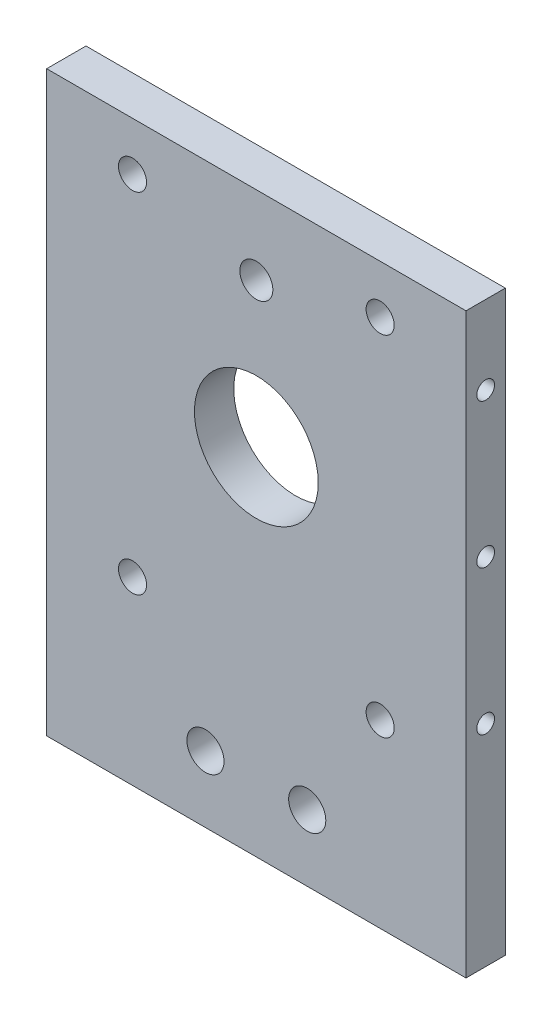
ISO-10303-21;
HEADER;
FILE_DESCRIPTION(('STEP AP214'),'2;1');
FILE_NAME('part.step','',(''),(''),'','','');
FILE_SCHEMA(('AUTOMOTIVE_DESIGN { 1 0 10303 214 1 1 1 1 }'));
ENDSEC;
DATA;
#1=APPLICATION_CONTEXT('core data for automotive mechanical design processes');
#2=APPLICATION_PROTOCOL_DEFINITION('international standard','automotive_design',2000,#1);
#3=PRODUCT_CONTEXT('',#1,'mechanical');
#4=PRODUCT('Part','Part','',(#3));
#5=PRODUCT_RELATED_PRODUCT_CATEGORY('part','',(#4));
#6=PRODUCT_DEFINITION_FORMATION('','',#4);
#7=PRODUCT_DEFINITION_CONTEXT('part definition',#1,'design');
#8=PRODUCT_DEFINITION('design','',#6,#7);
#9=PRODUCT_DEFINITION_SHAPE('','',#8);
#10=(LENGTH_UNIT() NAMED_UNIT(*) SI_UNIT(.MILLI.,.METRE.));
#11=(NAMED_UNIT(*) PLANE_ANGLE_UNIT() SI_UNIT($,.RADIAN.));
#12=(NAMED_UNIT(*) SI_UNIT($,.STERADIAN.) SOLID_ANGLE_UNIT());
#13=UNCERTAINTY_MEASURE_WITH_UNIT(LENGTH_MEASURE(1.E-05),#10,'distance_accuracy_value','');
#14=(GEOMETRIC_REPRESENTATION_CONTEXT(3) GLOBAL_UNCERTAINTY_ASSIGNED_CONTEXT((#13)) GLOBAL_UNIT_ASSIGNED_CONTEXT((#10,
#11,#12)) REPRESENTATION_CONTEXT('',''));
#15=CARTESIAN_POINT('',(0.,0.,0.));
#16=DIRECTION('',(0.,0.,1.));
#17=DIRECTION('',(1.,0.,0.));
#18=AXIS2_PLACEMENT_3D('',#15,#16,#17);
#19=CARTESIAN_POINT('',(50.8,54.,9.525));
#20=DIRECTION('',(-1.,0.,0.));
#21=DIRECTION('',(0.,-1.,0.));
#22=AXIS2_PLACEMENT_3D('',#19,#20,#21);
#23=PLANE('',#22);
#24=CARTESIAN_POINT('',(50.8,35.,4.76250000000001));
#25=DIRECTION('',(1.,0.,0.));
#26=DIRECTION('',(0.,-1.,0.));
#27=AXIS2_PLACEMENT_3D('',#24,#25,#26);
#28=CIRCLE('',#27,2.15);
#29=CARTESIAN_POINT('',(50.8,32.85,4.76250000000001));
#30=VERTEX_POINT('',#29);
#31=EDGE_CURVE('E103',#30,#30,#28,.T.);
#32=ORIENTED_EDGE('',*,*,#31,.F.);
#33=EDGE_LOOP('',(#32));
#34=FACE_BOUND('',#33,.T.);
#35=CARTESIAN_POINT('',(50.8,-35.,4.7625));
#36=DIRECTION('',(1.,0.,0.));
#37=DIRECTION('',(0.,1.,0.));
#38=AXIS2_PLACEMENT_3D('',#35,#36,#37);
#39=CIRCLE('',#38,2.15);
#40=CARTESIAN_POINT('',(50.8,-32.85,4.7625));
#41=VERTEX_POINT('',#40);
#42=EDGE_CURVE('E108',#41,#41,#39,.T.);
#43=ORIENTED_EDGE('',*,*,#42,.F.);
#44=EDGE_LOOP('',(#43));
#45=FACE_BOUND('',#44,.T.);
#46=CARTESIAN_POINT('',(50.8,0.,4.7625));
#47=DIRECTION('',(1.,0.,0.));
#48=DIRECTION('',(0.,1.,0.));
#49=AXIS2_PLACEMENT_3D('',#46,#47,#48);
#50=CIRCLE('',#49,2.15);
#51=CARTESIAN_POINT('',(50.8,2.15000000000001,4.7625));
#52=VERTEX_POINT('',#51);
#53=EDGE_CURVE('E107',#52,#52,#50,.T.);
#54=ORIENTED_EDGE('',*,*,#53,.F.);
#55=EDGE_LOOP('',(#54));
#56=FACE_BOUND('',#55,.T.);
#57=DIRECTION('',(0.,1.,0.));
#58=VECTOR('',#57,1.);
#59=CARTESIAN_POINT('',(50.8,54.,0.));
#60=LINE('',#59,#58);
#61=CARTESIAN_POINT('',(50.8,-86.,0.));
#62=VERTEX_POINT('',#61);
#63=CARTESIAN_POINT('',(50.8,54.,0.));
#64=VERTEX_POINT('',#63);
#65=EDGE_CURVE('E167',#62,#64,#60,.T.);
#66=ORIENTED_EDGE('',*,*,#65,.T.);
#67=DIRECTION('',(0.,0.,-1.));
#68=VECTOR('',#67,1.);
#69=CARTESIAN_POINT('',(50.8,54.,9.525));
#70=LINE('',#69,#68);
#71=CARTESIAN_POINT('',(50.8,54.,9.525));
#72=VERTEX_POINT('',#71);
#73=EDGE_CURVE('E11',#72,#64,#70,.T.);
#74=ORIENTED_EDGE('',*,*,#73,.F.);
#75=DIRECTION('',(0.,1.,0.));
#76=VECTOR('',#75,1.);
#77=CARTESIAN_POINT('',(50.8,54.,9.525));
#78=LINE('',#77,#76);
#79=CARTESIAN_POINT('',(50.8,-86.,9.525));
#80=VERTEX_POINT('',#79);
#81=EDGE_CURVE('E170',#80,#72,#78,.T.);
#82=ORIENTED_EDGE('',*,*,#81,.F.);
#83=DIRECTION('',(0.,0.,1.));
#84=VECTOR('',#83,1.);
#85=CARTESIAN_POINT('',(50.8,-86.,-106.520232819873));
#86=LINE('',#85,#84);
#87=EDGE_CURVE('E88',#62,#80,#86,.T.);
#88=ORIENTED_EDGE('',*,*,#87,.F.);
#89=EDGE_LOOP('',(#66,#74,#82,#88));
#90=FACE_BOUND('',#89,.T.);
#91=ADVANCED_FACE('F33',(#34,#45,#56,#90),#23,.F.);
#92=CARTESIAN_POINT('',(-50.8,54.,9.525));
#93=DIRECTION('',(0.,-1.,0.));
#94=DIRECTION('',(0.,0.,-1.));
#95=AXIS2_PLACEMENT_3D('',#92,#93,#94);
#96=PLANE('',#95);
#97=DIRECTION('',(-1.,0.,0.));
#98=VECTOR('',#97,1.);
#99=CARTESIAN_POINT('',(-50.8,54.,0.));
#100=LINE('',#99,#98);
#101=CARTESIAN_POINT('',(-50.8,54.,0.));
#102=VERTEX_POINT('',#101);
#103=EDGE_CURVE('E62',#64,#102,#100,.T.);
#104=ORIENTED_EDGE('',*,*,#103,.T.);
#105=DIRECTION('',(0.,0.,-1.));
#106=VECTOR('',#105,1.);
#107=CARTESIAN_POINT('',(-50.8,54.,9.525));
#108=LINE('',#107,#106);
#109=CARTESIAN_POINT('',(-50.8,54.,9.525));
#110=VERTEX_POINT('',#109);
#111=EDGE_CURVE('E42',#110,#102,#108,.T.);
#112=ORIENTED_EDGE('',*,*,#111,.F.);
#113=DIRECTION('',(-1.,0.,0.));
#114=VECTOR('',#113,1.);
#115=CARTESIAN_POINT('',(-50.8,54.,9.525));
#116=LINE('',#115,#114);
#117=EDGE_CURVE('E51',#72,#110,#116,.T.);
#118=ORIENTED_EDGE('',*,*,#117,.F.);
#119=ORIENTED_EDGE('',*,*,#73,.T.);
#120=EDGE_LOOP('',(#104,#112,#118,#119));
#121=FACE_BOUND('',#120,.T.);
#122=ADVANCED_FACE('F203',(#121),#96,.F.);
#123=CARTESIAN_POINT('',(-50.8,54.,9.525));
#124=DIRECTION('',(1.,0.,0.));
#125=DIRECTION('',(0.,1.,0.));
#126=AXIS2_PLACEMENT_3D('',#123,#124,#125);
#127=PLANE('',#126);
#128=CARTESIAN_POINT('',(-50.8,35.,4.76250000000001));
#129=DIRECTION('',(-1.,0.,0.));
#130=DIRECTION('',(0.,1.,0.));
#131=AXIS2_PLACEMENT_3D('',#128,#129,#130);
#132=CIRCLE('',#131,2.15);
#133=CARTESIAN_POINT('',(-50.8,37.15,4.76250000000001));
#134=VERTEX_POINT('',#133);
#135=EDGE_CURVE('E119',#134,#134,#132,.T.);
#136=ORIENTED_EDGE('',*,*,#135,.F.);
#137=EDGE_LOOP('',(#136));
#138=FACE_BOUND('',#137,.T.);
#139=CARTESIAN_POINT('',(-50.8,-35.,4.76250000000001));
#140=DIRECTION('',(-1.,0.,0.));
#141=DIRECTION('',(0.,-1.,0.));
#142=AXIS2_PLACEMENT_3D('',#139,#140,#141);
#143=CIRCLE('',#142,2.15);
#144=CARTESIAN_POINT('',(-50.8,-37.15,4.76250000000001));
#145=VERTEX_POINT('',#144);
#146=EDGE_CURVE('E126',#145,#145,#143,.T.);
#147=ORIENTED_EDGE('',*,*,#146,.F.);
#148=EDGE_LOOP('',(#147));
#149=FACE_BOUND('',#148,.T.);
#150=CARTESIAN_POINT('',(-50.8,0.,4.7625));
#151=DIRECTION('',(-1.,0.,0.));
#152=DIRECTION('',(0.,-1.,0.));
#153=AXIS2_PLACEMENT_3D('',#150,#151,#152);
#154=CIRCLE('',#153,2.15);
#155=CARTESIAN_POINT('',(-50.8,-2.14999999999999,4.7625));
#156=VERTEX_POINT('',#155);
#157=EDGE_CURVE('E125',#156,#156,#154,.T.);
#158=ORIENTED_EDGE('',*,*,#157,.F.);
#159=EDGE_LOOP('',(#158));
#160=FACE_BOUND('',#159,.T.);
#161=DIRECTION('',(0.,-1.,0.));
#162=VECTOR('',#161,1.);
#163=CARTESIAN_POINT('',(-50.8,54.,0.));
#164=LINE('',#163,#162);
#165=CARTESIAN_POINT('',(-50.7999999999999,-86.,0.));
#166=VERTEX_POINT('',#165);
#167=EDGE_CURVE('E68',#102,#166,#164,.T.);
#168=ORIENTED_EDGE('',*,*,#167,.T.);
#169=DIRECTION('',(0.,0.,1.));
#170=VECTOR('',#169,1.);
#171=CARTESIAN_POINT('',(-50.7999999999999,-86.,-106.520232819873));
#172=LINE('',#171,#170);
#173=CARTESIAN_POINT('',(-50.7999999999999,-86.,9.525));
#174=VERTEX_POINT('',#173);
#175=EDGE_CURVE('E84',#166,#174,#172,.T.);
#176=ORIENTED_EDGE('',*,*,#175,.T.);
#177=DIRECTION('',(0.,-1.,0.));
#178=VECTOR('',#177,1.);
#179=CARTESIAN_POINT('',(-50.8,54.,9.525));
#180=LINE('',#179,#178);
#181=EDGE_CURVE('E78',#110,#174,#180,.T.);
#182=ORIENTED_EDGE('',*,*,#181,.F.);
#183=ORIENTED_EDGE('',*,*,#111,.T.);
#184=EDGE_LOOP('',(#168,#176,#182,#183));
#185=FACE_BOUND('',#184,.T.);
#186=ADVANCED_FACE('F85',(#138,#149,#160,#185),#127,.F.);
#187=CARTESIAN_POINT('',(0.,0.,9.525));
#188=DIRECTION('',(0.,0.,1.));
#189=DIRECTION('',(1.,0.,0.));
#190=AXIS2_PLACEMENT_3D('',#187,#188,#189);
#191=PLANE('',#190);
#192=CARTESIAN_POINT('',(12.3290206143521,-69.9213504638668,9.525));
#193=DIRECTION('',(0.,0.,1.));
#194=DIRECTION('',(1.,0.,0.));
#195=AXIS2_PLACEMENT_3D('',#192,#193,#194);
#196=CIRCLE('',#195,4.5);
#197=CARTESIAN_POINT('',(16.8290206143521,-69.9213504638668,9.525));
#198=VERTEX_POINT('',#197);
#199=EDGE_CURVE('E180',#198,#198,#196,.T.);
#200=ORIENTED_EDGE('',*,*,#199,.F.);
#201=EDGE_LOOP('',(#200));
#202=FACE_BOUND('',#201,.T.);
#203=CARTESIAN_POINT('',(-12.3290206143521,-69.9213504638668,9.525));
#204=DIRECTION('',(0.,0.,1.));
#205=DIRECTION('',(-1.,0.,0.));
#206=AXIS2_PLACEMENT_3D('',#203,#204,#205);
#207=CIRCLE('',#206,4.5);
#208=CARTESIAN_POINT('',(-16.8290206143521,-69.9213504638668,9.525));
#209=VERTEX_POINT('',#208);
#210=EDGE_CURVE('E508',#209,#209,#207,.T.);
#211=ORIENTED_EDGE('',*,*,#210,.F.);
#212=EDGE_LOOP('',(#211));
#213=FACE_BOUND('',#212,.T.);
#214=CARTESIAN_POINT('',(0.,35.0048847139097,9.525));
#215=DIRECTION('',(0.,0.,1.));
#216=DIRECTION('',(1.,0.,0.));
#217=AXIS2_PLACEMENT_3D('',#214,#215,#216);
#218=CIRCLE('',#217,4.);
#219=CARTESIAN_POINT('',(4.,35.0048847139097,9.525));
#220=VERTEX_POINT('',#219);
#221=EDGE_CURVE('E98',#220,#220,#218,.T.);
#222=ORIENTED_EDGE('',*,*,#221,.F.);
#223=EDGE_LOOP('',(#222));
#224=FACE_BOUND('',#223,.T.);
#225=CARTESIAN_POINT('',(-30.,42.25,9.525));
#226=DIRECTION('',(0.,0.,1.));
#227=DIRECTION('',(1.,0.,0.));
#228=AXIS2_PLACEMENT_3D('',#225,#226,#227);
#229=CIRCLE('',#228,3.4);
#230=CARTESIAN_POINT('',(-26.6,42.25,9.525));
#231=VERTEX_POINT('',#230);
#232=EDGE_CURVE('E137',#231,#231,#229,.T.);
#233=ORIENTED_EDGE('',*,*,#232,.F.);
#234=EDGE_LOOP('',(#233));
#235=FACE_BOUND('',#234,.T.);
#236=CARTESIAN_POINT('',(30.,42.25,9.525));
#237=DIRECTION('',(0.,0.,1.));
#238=DIRECTION('',(-1.,0.,0.));
#239=AXIS2_PLACEMENT_3D('',#236,#237,#238);
#240=CIRCLE('',#239,3.4);
#241=CARTESIAN_POINT('',(26.6,42.25,9.525));
#242=VERTEX_POINT('',#241);
#243=EDGE_CURVE('E156',#242,#242,#240,.T.);
#244=ORIENTED_EDGE('',*,*,#243,.F.);
#245=EDGE_LOOP('',(#244));
#246=FACE_BOUND('',#245,.T.);
#247=CARTESIAN_POINT('',(-30.,-42.25,9.525));
#248=DIRECTION('',(0.,0.,1.));
#249=DIRECTION('',(-1.,0.,0.));
#250=AXIS2_PLACEMENT_3D('',#247,#248,#249);
#251=CIRCLE('',#250,3.4);
#252=CARTESIAN_POINT('',(-33.4,-42.25,9.525));
#253=VERTEX_POINT('',#252);
#254=EDGE_CURVE('E150',#253,#253,#251,.T.);
#255=ORIENTED_EDGE('',*,*,#254,.F.);
#256=EDGE_LOOP('',(#255));
#257=FACE_BOUND('',#256,.T.);
#258=CARTESIAN_POINT('',(30.,-42.25,9.525));
#259=DIRECTION('',(0.,0.,1.));
#260=DIRECTION('',(1.,0.,0.));
#261=AXIS2_PLACEMENT_3D('',#258,#259,#260);
#262=CIRCLE('',#261,3.4);
#263=CARTESIAN_POINT('',(33.4,-42.25,9.525));
#264=VERTEX_POINT('',#263);
#265=EDGE_CURVE('E144',#264,#264,#262,.T.);
#266=ORIENTED_EDGE('',*,*,#265,.F.);
#267=EDGE_LOOP('',(#266));
#268=FACE_BOUND('',#267,.T.);
#269=CARTESIAN_POINT('',(0.,0.,9.525));
#270=DIRECTION('',(0.,0.,1.));
#271=DIRECTION('',(1.,0.,0.));
#272=AXIS2_PLACEMENT_3D('',#269,#270,#271);
#273=CIRCLE('',#272,15.);
#274=CARTESIAN_POINT('',(15.,0.,9.525));
#275=VERTEX_POINT('',#274);
#276=EDGE_CURVE('E143',#275,#275,#273,.T.);
#277=ORIENTED_EDGE('',*,*,#276,.F.);
#278=EDGE_LOOP('',(#277));
#279=FACE_BOUND('',#278,.T.);
#280=ORIENTED_EDGE('',*,*,#81,.T.);
#281=ORIENTED_EDGE('',*,*,#117,.T.);
#282=ORIENTED_EDGE('',*,*,#181,.T.);
#283=DIRECTION('',(1.,0.,0.));
#284=VECTOR('',#283,1.);
#285=CARTESIAN_POINT('',(-50.7999999999999,-86.,9.525));
#286=LINE('',#285,#284);
#287=EDGE_CURVE('E81',#174,#80,#286,.T.);
#288=ORIENTED_EDGE('',*,*,#287,.T.);
#289=EDGE_LOOP('',(#280,#281,#282,#288));
#290=FACE_BOUND('',#289,.T.);
#291=ADVANCED_FACE('F79',(#202,#213,#224,#235,#246,#257,#268,#279,#290),#191,.T.);
#292=CARTESIAN_POINT('',(0.,0.,0.));
#293=DIRECTION('',(0.,0.,1.));
#294=DIRECTION('',(1.,0.,0.));
#295=AXIS2_PLACEMENT_3D('',#292,#293,#294);
#296=PLANE('',#295);
#297=CARTESIAN_POINT('',(12.3290206143521,-69.9213504638668,0.));
#298=DIRECTION('',(0.,0.,1.));
#299=DIRECTION('',(1.,0.,0.));
#300=AXIS2_PLACEMENT_3D('',#297,#298,#299);
#301=CIRCLE('',#300,4.5);
#302=CARTESIAN_POINT('',(16.8290206143521,-69.9213504638668,0.));
#303=VERTEX_POINT('',#302);
#304=EDGE_CURVE('E36',#303,#303,#301,.T.);
#305=ORIENTED_EDGE('',*,*,#304,.T.);
#306=EDGE_LOOP('',(#305));
#307=FACE_BOUND('',#306,.T.);
#308=CARTESIAN_POINT('',(-12.3290206143521,-69.9213504638668,0.));
#309=DIRECTION('',(0.,0.,1.));
#310=DIRECTION('',(1.,0.,0.));
#311=AXIS2_PLACEMENT_3D('',#308,#309,#310);
#312=CIRCLE('',#311,4.5);
#313=CARTESIAN_POINT('',(-7.82902061435211,-69.9213504638668,0.));
#314=VERTEX_POINT('',#313);
#315=EDGE_CURVE('E95',#314,#314,#312,.T.);
#316=ORIENTED_EDGE('',*,*,#315,.T.);
#317=EDGE_LOOP('',(#316));
#318=FACE_BOUND('',#317,.T.);
#319=CARTESIAN_POINT('',(0.,35.0048847139097,0.));
#320=DIRECTION('',(0.,0.,1.));
#321=DIRECTION('',(1.,0.,0.));
#322=AXIS2_PLACEMENT_3D('',#319,#320,#321);
#323=CIRCLE('',#322,4.);
#324=CARTESIAN_POINT('',(4.,35.0048847139097,0.));
#325=VERTEX_POINT('',#324);
#326=EDGE_CURVE('E178',#325,#325,#323,.T.);
#327=ORIENTED_EDGE('',*,*,#326,.T.);
#328=EDGE_LOOP('',(#327));
#329=FACE_BOUND('',#328,.T.);
#330=CARTESIAN_POINT('',(-30.,42.25,0.));
#331=DIRECTION('',(0.,0.,1.));
#332=DIRECTION('',(1.,0.,0.));
#333=AXIS2_PLACEMENT_3D('',#330,#331,#332);
#334=CIRCLE('',#333,3.4);
#335=CARTESIAN_POINT('',(-26.6,42.25,0.));
#336=VERTEX_POINT('',#335);
#337=EDGE_CURVE('E159',#336,#336,#334,.T.);
#338=ORIENTED_EDGE('',*,*,#337,.T.);
#339=EDGE_LOOP('',(#338));
#340=FACE_BOUND('',#339,.T.);
#341=CARTESIAN_POINT('',(30.,42.25,0.));
#342=DIRECTION('',(0.,0.,1.));
#343=DIRECTION('',(-1.,0.,0.));
#344=AXIS2_PLACEMENT_3D('',#341,#342,#343);
#345=CIRCLE('',#344,3.4);
#346=CARTESIAN_POINT('',(26.6,42.25,0.));
#347=VERTEX_POINT('',#346);
#348=EDGE_CURVE('E153',#347,#347,#345,.T.);
#349=ORIENTED_EDGE('',*,*,#348,.T.);
#350=EDGE_LOOP('',(#349));
#351=FACE_BOUND('',#350,.T.);
#352=CARTESIAN_POINT('',(-30.,-42.25,0.));
#353=DIRECTION('',(0.,0.,1.));
#354=DIRECTION('',(-1.,0.,0.));
#355=AXIS2_PLACEMENT_3D('',#352,#353,#354);
#356=CIRCLE('',#355,3.4);
#357=CARTESIAN_POINT('',(-33.4,-42.25,0.));
#358=VERTEX_POINT('',#357);
#359=EDGE_CURVE('E147',#358,#358,#356,.T.);
#360=ORIENTED_EDGE('',*,*,#359,.T.);
#361=EDGE_LOOP('',(#360));
#362=FACE_BOUND('',#361,.T.);
#363=CARTESIAN_POINT('',(30.,-42.25,0.));
#364=DIRECTION('',(0.,0.,1.));
#365=DIRECTION('',(1.,0.,0.));
#366=AXIS2_PLACEMENT_3D('',#363,#364,#365);
#367=CIRCLE('',#366,3.4);
#368=CARTESIAN_POINT('',(33.4,-42.25,0.));
#369=VERTEX_POINT('',#368);
#370=EDGE_CURVE('E140',#369,#369,#367,.T.);
#371=ORIENTED_EDGE('',*,*,#370,.T.);
#372=EDGE_LOOP('',(#371));
#373=FACE_BOUND('',#372,.T.);
#374=CARTESIAN_POINT('',(0.,0.,0.));
#375=DIRECTION('',(0.,0.,1.));
#376=DIRECTION('',(1.,0.,0.));
#377=AXIS2_PLACEMENT_3D('',#374,#375,#376);
#378=CIRCLE('',#377,15.);
#379=CARTESIAN_POINT('',(15.,0.,0.));
#380=VERTEX_POINT('',#379);
#381=EDGE_CURVE('E164',#380,#380,#378,.T.);
#382=ORIENTED_EDGE('',*,*,#381,.T.);
#383=EDGE_LOOP('',(#382));
#384=FACE_BOUND('',#383,.T.);
#385=ORIENTED_EDGE('',*,*,#65,.F.);
#386=DIRECTION('',(-1.,0.,0.));
#387=VECTOR('',#386,1.);
#388=CARTESIAN_POINT('',(-50.7999999999999,-86.,0.));
#389=LINE('',#388,#387);
#390=EDGE_CURVE('E100',#62,#166,#389,.T.);
#391=ORIENTED_EDGE('',*,*,#390,.T.);
#392=ORIENTED_EDGE('',*,*,#167,.F.);
#393=ORIENTED_EDGE('',*,*,#103,.F.);
#394=EDGE_LOOP('',(#385,#391,#392,#393));
#395=FACE_BOUND('',#394,.T.);
#396=ADVANCED_FACE('F184',(#307,#318,#329,#340,#351,#362,#373,#384,#395),#296,.F.);
#397=CARTESIAN_POINT('',(0.,0.,0.));
#398=DIRECTION('',(0.,0.,1.));
#399=DIRECTION('',(1.,0.,0.));
#400=AXIS2_PLACEMENT_3D('',#397,#398,#399);
#401=CYLINDRICAL_SURFACE('',#400,15.);
#402=ORIENTED_EDGE('',*,*,#381,.F.);
#403=EDGE_LOOP('',(#402));
#404=FACE_BOUND('',#403,.T.);
#405=ORIENTED_EDGE('',*,*,#276,.T.);
#406=EDGE_LOOP('',(#405));
#407=FACE_BOUND('',#406,.T.);
#408=ADVANCED_FACE('F217',(#404,#407),#401,.F.);
#409=CARTESIAN_POINT('',(30.,-42.25,0.));
#410=DIRECTION('',(0.,0.,1.));
#411=DIRECTION('',(1.,0.,0.));
#412=AXIS2_PLACEMENT_3D('',#409,#410,#411);
#413=CYLINDRICAL_SURFACE('',#412,3.4);
#414=ORIENTED_EDGE('',*,*,#370,.F.);
#415=EDGE_LOOP('',(#414));
#416=FACE_BOUND('',#415,.T.);
#417=ORIENTED_EDGE('',*,*,#265,.T.);
#418=EDGE_LOOP('',(#417));
#419=FACE_BOUND('',#418,.T.);
#420=ADVANCED_FACE('F224',(#416,#419),#413,.F.);
#421=CARTESIAN_POINT('',(-30.,-42.25,0.));
#422=DIRECTION('',(0.,0.,1.));
#423=DIRECTION('',(1.,0.,0.));
#424=AXIS2_PLACEMENT_3D('',#421,#422,#423);
#425=CYLINDRICAL_SURFACE('',#424,3.4);
#426=ORIENTED_EDGE('',*,*,#359,.F.);
#427=EDGE_LOOP('',(#426));
#428=FACE_BOUND('',#427,.T.);
#429=ORIENTED_EDGE('',*,*,#254,.T.);
#430=EDGE_LOOP('',(#429));
#431=FACE_BOUND('',#430,.T.);
#432=ADVANCED_FACE('F261',(#428,#431),#425,.F.);
#433=CARTESIAN_POINT('',(30.,42.25,0.));
#434=DIRECTION('',(0.,0.,1.));
#435=DIRECTION('',(1.,0.,0.));
#436=AXIS2_PLACEMENT_3D('',#433,#434,#435);
#437=CYLINDRICAL_SURFACE('',#436,3.4);
#438=ORIENTED_EDGE('',*,*,#348,.F.);
#439=EDGE_LOOP('',(#438));
#440=FACE_BOUND('',#439,.T.);
#441=ORIENTED_EDGE('',*,*,#243,.T.);
#442=EDGE_LOOP('',(#441));
#443=FACE_BOUND('',#442,.T.);
#444=ADVANCED_FACE('F253',(#440,#443),#437,.F.);
#445=CARTESIAN_POINT('',(-30.,42.25,0.));
#446=DIRECTION('',(0.,0.,1.));
#447=DIRECTION('',(1.,0.,0.));
#448=AXIS2_PLACEMENT_3D('',#445,#446,#447);
#449=CYLINDRICAL_SURFACE('',#448,3.4);
#450=ORIENTED_EDGE('',*,*,#337,.F.);
#451=EDGE_LOOP('',(#450));
#452=FACE_BOUND('',#451,.T.);
#453=ORIENTED_EDGE('',*,*,#232,.T.);
#454=EDGE_LOOP('',(#453));
#455=FACE_BOUND('',#454,.T.);
#456=ADVANCED_FACE('F243',(#452,#455),#449,.F.);
#457=CARTESIAN_POINT('',(-35.8,0.,4.7625));
#458=DIRECTION('',(-1.,0.,0.));
#459=DIRECTION('',(0.,-1.,0.));
#460=AXIS2_PLACEMENT_3D('',#457,#458,#459);
#461=CYLINDRICAL_SURFACE('',#460,2.15);
#462=CARTESIAN_POINT('',(-35.8,0.,4.7625));
#463=DIRECTION('',(-1.,0.,0.));
#464=DIRECTION('',(0.,-1.,0.));
#465=AXIS2_PLACEMENT_3D('',#462,#463,#464);
#466=CIRCLE('',#465,2.15);
#467=CARTESIAN_POINT('',(-35.8,-2.14999999999998,4.7625));
#468=VERTEX_POINT('',#467);
#469=EDGE_CURVE('E134',#468,#468,#466,.T.);
#470=ORIENTED_EDGE('',*,*,#469,.F.);
#471=EDGE_LOOP('',(#470));
#472=FACE_BOUND('',#471,.T.);
#473=ORIENTED_EDGE('',*,*,#157,.T.);
#474=EDGE_LOOP('',(#473));
#475=FACE_BOUND('',#474,.T.);
#476=ADVANCED_FACE('F240',(#472,#475),#461,.F.);
#477=CARTESIAN_POINT('',(-35.8,0.,4.7625));
#478=DIRECTION('',(-1.,0.,0.));
#479=DIRECTION('',(0.,-1.,0.));
#480=AXIS2_PLACEMENT_3D('',#477,#478,#479);
#481=PLANE('',#480);
#482=ORIENTED_EDGE('',*,*,#469,.T.);
#483=EDGE_LOOP('',(#482));
#484=FACE_BOUND('',#483,.T.);
#485=ADVANCED_FACE('F242',(#484),#481,.T.);
#486=CARTESIAN_POINT('',(-35.8,-35.,4.76250000000001));
#487=DIRECTION('',(-1.,0.,0.));
#488=DIRECTION('',(0.,-1.,0.));
#489=AXIS2_PLACEMENT_3D('',#486,#487,#488);
#490=CYLINDRICAL_SURFACE('',#489,2.15);
#491=CARTESIAN_POINT('',(-35.8,-35.,4.76250000000001));
#492=DIRECTION('',(-1.,0.,0.));
#493=DIRECTION('',(0.,-1.,0.));
#494=AXIS2_PLACEMENT_3D('',#491,#492,#493);
#495=CIRCLE('',#494,2.15);
#496=CARTESIAN_POINT('',(-35.8,-37.15,4.76250000000001));
#497=VERTEX_POINT('',#496);
#498=EDGE_CURVE('E122',#497,#497,#495,.T.);
#499=ORIENTED_EDGE('',*,*,#498,.F.);
#500=EDGE_LOOP('',(#499));
#501=FACE_BOUND('',#500,.T.);
#502=ORIENTED_EDGE('',*,*,#146,.T.);
#503=EDGE_LOOP('',(#502));
#504=FACE_BOUND('',#503,.T.);
#505=ADVANCED_FACE('F250',(#501,#504),#490,.F.);
#506=CARTESIAN_POINT('',(-35.8,-35.,4.76250000000001));
#507=DIRECTION('',(-1.,0.,0.));
#508=DIRECTION('',(0.,-1.,0.));
#509=AXIS2_PLACEMENT_3D('',#506,#507,#508);
#510=PLANE('',#509);
#511=ORIENTED_EDGE('',*,*,#498,.T.);
#512=EDGE_LOOP('',(#511));
#513=FACE_BOUND('',#512,.T.);
#514=ADVANCED_FACE('F315',(#513),#510,.T.);
#515=CARTESIAN_POINT('',(-35.8,35.,4.76250000000001));
#516=DIRECTION('',(-1.,0.,0.));
#517=DIRECTION('',(0.,-1.,0.));
#518=AXIS2_PLACEMENT_3D('',#515,#516,#517);
#519=CYLINDRICAL_SURFACE('',#518,2.15);
#520=CARTESIAN_POINT('',(-35.8,35.,4.76250000000001));
#521=DIRECTION('',(-1.,0.,0.));
#522=DIRECTION('',(0.,1.,0.));
#523=AXIS2_PLACEMENT_3D('',#520,#521,#522);
#524=CIRCLE('',#523,2.15);
#525=CARTESIAN_POINT('',(-35.8,37.15,4.76250000000001));
#526=VERTEX_POINT('',#525);
#527=EDGE_CURVE('E129',#526,#526,#524,.T.);
#528=ORIENTED_EDGE('',*,*,#527,.F.);
#529=EDGE_LOOP('',(#528));
#530=FACE_BOUND('',#529,.T.);
#531=ORIENTED_EDGE('',*,*,#135,.T.);
#532=EDGE_LOOP('',(#531));
#533=FACE_BOUND('',#532,.T.);
#534=ADVANCED_FACE('F325',(#530,#533),#519,.F.);
#535=CARTESIAN_POINT('',(-35.8,35.,4.76250000000001));
#536=DIRECTION('',(1.,0.,0.));
#537=DIRECTION('',(0.,1.,0.));
#538=AXIS2_PLACEMENT_3D('',#535,#536,#537);
#539=PLANE('',#538);
#540=ORIENTED_EDGE('',*,*,#527,.T.);
#541=EDGE_LOOP('',(#540));
#542=FACE_BOUND('',#541,.T.);
#543=ADVANCED_FACE('F335',(#542),#539,.F.);
#544=CARTESIAN_POINT('',(35.8,0.,4.7625));
#545=DIRECTION('',(1.,0.,0.));
#546=DIRECTION('',(0.,1.,0.));
#547=AXIS2_PLACEMENT_3D('',#544,#545,#546);
#548=CYLINDRICAL_SURFACE('',#547,2.15);
#549=CARTESIAN_POINT('',(35.8,0.,4.7625));
#550=DIRECTION('',(1.,0.,0.));
#551=DIRECTION('',(0.,1.,0.));
#552=AXIS2_PLACEMENT_3D('',#549,#550,#551);
#553=CIRCLE('',#552,2.15);
#554=CARTESIAN_POINT('',(35.8,2.15000000000001,4.7625));
#555=VERTEX_POINT('',#554);
#556=EDGE_CURVE('E116',#555,#555,#553,.T.);
#557=ORIENTED_EDGE('',*,*,#556,.F.);
#558=EDGE_LOOP('',(#557));
#559=FACE_BOUND('',#558,.T.);
#560=ORIENTED_EDGE('',*,*,#53,.T.);
#561=EDGE_LOOP('',(#560));
#562=FACE_BOUND('',#561,.T.);
#563=ADVANCED_FACE('F344',(#559,#562),#548,.F.);
#564=CARTESIAN_POINT('',(35.8,0.,4.7625));
#565=DIRECTION('',(1.,0.,0.));
#566=DIRECTION('',(0.,1.,0.));
#567=AXIS2_PLACEMENT_3D('',#564,#565,#566);
#568=PLANE('',#567);
#569=ORIENTED_EDGE('',*,*,#556,.T.);
#570=EDGE_LOOP('',(#569));
#571=FACE_BOUND('',#570,.T.);
#572=ADVANCED_FACE('F354',(#571),#568,.T.);
#573=CARTESIAN_POINT('',(35.8,-35.,4.7625));
#574=DIRECTION('',(1.,0.,0.));
#575=DIRECTION('',(0.,1.,0.));
#576=AXIS2_PLACEMENT_3D('',#573,#574,#575);
#577=CYLINDRICAL_SURFACE('',#576,2.15);
#578=CARTESIAN_POINT('',(35.8,-35.,4.7625));
#579=DIRECTION('',(1.,0.,0.));
#580=DIRECTION('',(0.,1.,0.));
#581=AXIS2_PLACEMENT_3D('',#578,#579,#580);
#582=CIRCLE('',#581,2.15);
#583=CARTESIAN_POINT('',(35.8,-32.85,4.7625));
#584=VERTEX_POINT('',#583);
#585=EDGE_CURVE('E104',#584,#584,#582,.T.);
#586=ORIENTED_EDGE('',*,*,#585,.F.);
#587=EDGE_LOOP('',(#586));
#588=FACE_BOUND('',#587,.T.);
#589=ORIENTED_EDGE('',*,*,#42,.T.);
#590=EDGE_LOOP('',(#589));
#591=FACE_BOUND('',#590,.T.);
#592=ADVANCED_FACE('F364',(#588,#591),#577,.F.);
#593=CARTESIAN_POINT('',(35.8,-35.,4.7625));
#594=DIRECTION('',(1.,0.,0.));
#595=DIRECTION('',(0.,1.,0.));
#596=AXIS2_PLACEMENT_3D('',#593,#594,#595);
#597=PLANE('',#596);
#598=ORIENTED_EDGE('',*,*,#585,.T.);
#599=EDGE_LOOP('',(#598));
#600=FACE_BOUND('',#599,.T.);
#601=ADVANCED_FACE('F374',(#600),#597,.T.);
#602=CARTESIAN_POINT('',(35.8,35.,4.76250000000001));
#603=DIRECTION('',(1.,0.,0.));
#604=DIRECTION('',(0.,1.,0.));
#605=AXIS2_PLACEMENT_3D('',#602,#603,#604);
#606=CYLINDRICAL_SURFACE('',#605,2.15);
#607=CARTESIAN_POINT('',(35.8,35.,4.76250000000001));
#608=DIRECTION('',(1.,0.,0.));
#609=DIRECTION('',(0.,-1.,0.));
#610=AXIS2_PLACEMENT_3D('',#607,#608,#609);
#611=CIRCLE('',#610,2.15);
#612=CARTESIAN_POINT('',(35.8,32.85,4.76250000000001));
#613=VERTEX_POINT('',#612);
#614=EDGE_CURVE('E111',#613,#613,#611,.T.);
#615=ORIENTED_EDGE('',*,*,#614,.F.);
#616=EDGE_LOOP('',(#615));
#617=FACE_BOUND('',#616,.T.);
#618=ORIENTED_EDGE('',*,*,#31,.T.);
#619=EDGE_LOOP('',(#618));
#620=FACE_BOUND('',#619,.T.);
#621=ADVANCED_FACE('F384',(#617,#620),#606,.F.);
#622=CARTESIAN_POINT('',(35.8,35.,4.76250000000001));
#623=DIRECTION('',(-1.,0.,0.));
#624=DIRECTION('',(0.,-1.,0.));
#625=AXIS2_PLACEMENT_3D('',#622,#623,#624);
#626=PLANE('',#625);
#627=ORIENTED_EDGE('',*,*,#614,.T.);
#628=EDGE_LOOP('',(#627));
#629=FACE_BOUND('',#628,.T.);
#630=ADVANCED_FACE('F394',(#629),#626,.F.);
#631=CARTESIAN_POINT('',(-50.7999999999999,-86.,-106.520232819873));
#632=DIRECTION('',(0.,-1.,0.));
#633=DIRECTION('',(1.,0.,0.));
#634=AXIS2_PLACEMENT_3D('',#631,#632,#633);
#635=PLANE('',#634);
#636=ORIENTED_EDGE('',*,*,#390,.F.);
#637=ORIENTED_EDGE('',*,*,#87,.T.);
#638=ORIENTED_EDGE('',*,*,#287,.F.);
#639=ORIENTED_EDGE('',*,*,#175,.F.);
#640=EDGE_LOOP('',(#636,#637,#638,#639));
#641=FACE_BOUND('',#640,.T.);
#642=ADVANCED_FACE('F91',(#641),#635,.T.);
#643=CARTESIAN_POINT('',(0.,35.0048847139097,-92.075));
#644=DIRECTION('',(0.,0.,1.));
#645=DIRECTION('',(1.,0.,0.));
#646=AXIS2_PLACEMENT_3D('',#643,#644,#645);
#647=CYLINDRICAL_SURFACE('',#646,4.);
#648=ORIENTED_EDGE('',*,*,#221,.T.);
#649=EDGE_LOOP('',(#648));
#650=FACE_BOUND('',#649,.T.);
#651=ORIENTED_EDGE('',*,*,#326,.F.);
#652=EDGE_LOOP('',(#651));
#653=FACE_BOUND('',#652,.T.);
#654=ADVANCED_FACE('F190',(#650,#653),#647,.F.);
#655=CARTESIAN_POINT('',(-12.3290206143521,-69.9213504638668,-92.075));
#656=DIRECTION('',(0.,0.,1.));
#657=DIRECTION('',(1.,0.,0.));
#658=AXIS2_PLACEMENT_3D('',#655,#656,#657);
#659=CYLINDRICAL_SURFACE('',#658,4.5);
#660=ORIENTED_EDGE('',*,*,#210,.T.);
#661=EDGE_LOOP('',(#660));
#662=FACE_BOUND('',#661,.T.);
#663=ORIENTED_EDGE('',*,*,#315,.F.);
#664=EDGE_LOOP('',(#663));
#665=FACE_BOUND('',#664,.T.);
#666=ADVANCED_FACE('F187',(#662,#665),#659,.F.);
#667=CARTESIAN_POINT('',(12.3290206143521,-69.9213504638668,-92.075));
#668=DIRECTION('',(0.,0.,1.));
#669=DIRECTION('',(1.,0.,0.));
#670=AXIS2_PLACEMENT_3D('',#667,#668,#669);
#671=CYLINDRICAL_SURFACE('',#670,4.5);
#672=ORIENTED_EDGE('',*,*,#199,.T.);
#673=EDGE_LOOP('',(#672));
#674=FACE_BOUND('',#673,.T.);
#675=ORIENTED_EDGE('',*,*,#304,.F.);
#676=EDGE_LOOP('',(#675));
#677=FACE_BOUND('',#676,.T.);
#678=ADVANCED_FACE('F189',(#674,#677),#671,.F.);
#679=CLOSED_SHELL('',(#91,#122,#186,#291,#396,#408,#420,#432,#444,#456,#476,#485,#505,#514,#534,
#543,#563,#572,#592,#601,#621,#630,#642,#654,#666,#678));
#680=MANIFOLD_SOLID_BREP('B2',#679);
#681=ADVANCED_BREP_SHAPE_REPRESENTATION('',(#18,#680),#14);
#682=SHAPE_DEFINITION_REPRESENTATION(#9,#681);
ENDSEC;
END-ISO-10303-21;
